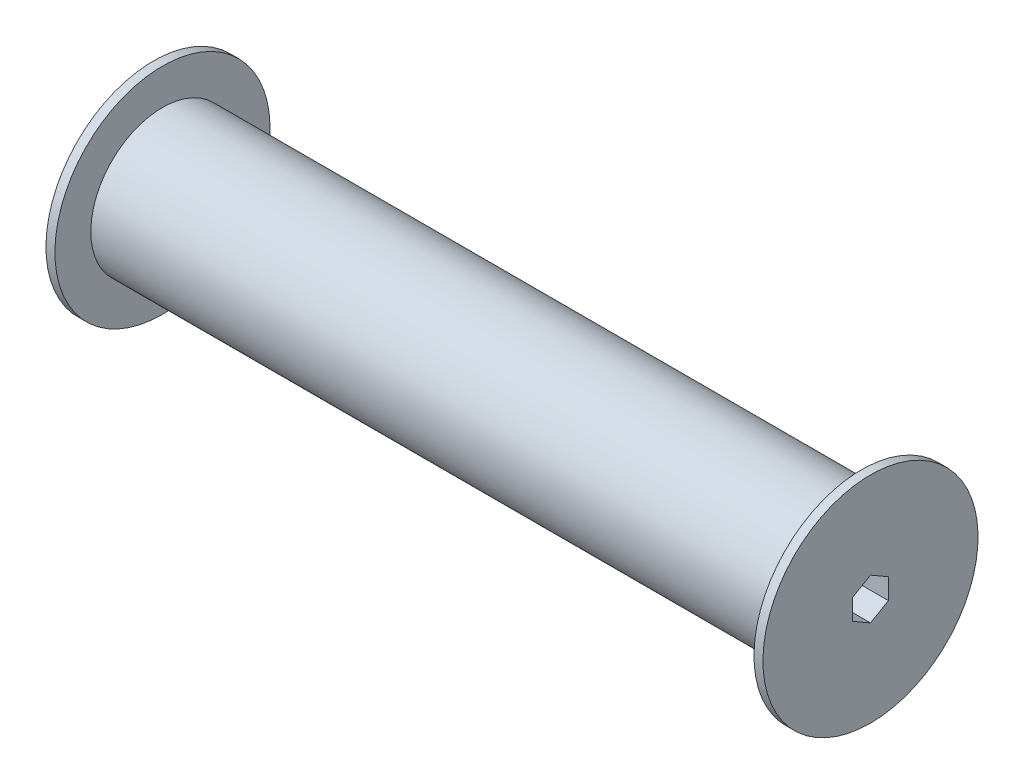
ISO-10303-21;
HEADER;
FILE_DESCRIPTION(('STEP AP214'),'2;1');
FILE_NAME('part.step','',(''),(''),'','','');
FILE_SCHEMA(('AUTOMOTIVE_DESIGN { 1 0 10303 214 1 1 1 1 }'));
ENDSEC;
DATA;
#1=APPLICATION_CONTEXT('core data for automotive mechanical design processes');
#2=APPLICATION_PROTOCOL_DEFINITION('international standard','automotive_design',2000,#1);
#3=PRODUCT_CONTEXT('',#1,'mechanical');
#4=PRODUCT('Part','Part','',(#3));
#5=PRODUCT_RELATED_PRODUCT_CATEGORY('part','',(#4));
#6=PRODUCT_DEFINITION_FORMATION('','',#4);
#7=PRODUCT_DEFINITION_CONTEXT('part definition',#1,'design');
#8=PRODUCT_DEFINITION('design','',#6,#7);
#9=PRODUCT_DEFINITION_SHAPE('','',#8);
#10=(LENGTH_UNIT() NAMED_UNIT(*) SI_UNIT(.MILLI.,.METRE.));
#11=(NAMED_UNIT(*) PLANE_ANGLE_UNIT() SI_UNIT($,.RADIAN.));
#12=(NAMED_UNIT(*) SI_UNIT($,.STERADIAN.) SOLID_ANGLE_UNIT());
#13=UNCERTAINTY_MEASURE_WITH_UNIT(LENGTH_MEASURE(1.E-05),#10,'distance_accuracy_value','');
#14=(GEOMETRIC_REPRESENTATION_CONTEXT(3) GLOBAL_UNCERTAINTY_ASSIGNED_CONTEXT((#13)) GLOBAL_UNIT_ASSIGNED_CONTEXT((#10,
#11,#12)) REPRESENTATION_CONTEXT('',''));
#15=CARTESIAN_POINT('',(0.,0.,0.));
#16=DIRECTION('',(0.,0.,1.));
#17=DIRECTION('',(1.,0.,0.));
#18=AXIS2_PLACEMENT_3D('',#15,#16,#17);
#19=CARTESIAN_POINT('',(-127.,0.,0.));
#20=DIRECTION('',(-1.,0.,0.));
#21=DIRECTION('',(0.,-1.,0.));
#22=AXIS2_PLACEMENT_3D('',#19,#20,#21);
#23=CYLINDRICAL_SURFACE('',#22,38.1);
#24=CARTESIAN_POINT('',(-127.,0.,0.));
#25=DIRECTION('',(-1.,0.,0.));
#26=DIRECTION('',(0.,-1.,0.));
#27=AXIS2_PLACEMENT_3D('',#24,#25,#26);
#28=CIRCLE('',#27,38.1);
#29=CARTESIAN_POINT('',(-127.,-38.1,0.));
#30=VERTEX_POINT('',#29);
#31=EDGE_CURVE('E11',#30,#30,#28,.T.);
#32=ORIENTED_EDGE('',*,*,#31,.F.);
#33=EDGE_LOOP('',(#32));
#34=FACE_BOUND('',#33,.T.);
#35=CARTESIAN_POINT('',(-123.825,0.,0.));
#36=DIRECTION('',(-1.,0.,0.));
#37=DIRECTION('',(0.,-1.,0.));
#38=AXIS2_PLACEMENT_3D('',#35,#36,#37);
#39=CIRCLE('',#38,38.1);
#40=CARTESIAN_POINT('',(-123.825,-38.1,0.));
#41=VERTEX_POINT('',#40);
#42=EDGE_CURVE('E130',#41,#41,#39,.T.);
#43=ORIENTED_EDGE('',*,*,#42,.T.);
#44=EDGE_LOOP('',(#43));
#45=FACE_BOUND('',#44,.T.);
#46=ADVANCED_FACE('F33',(#34,#45),#23,.T.);
#47=CARTESIAN_POINT('',(-127.,38.1,0.));
#48=DIRECTION('',(1.,0.,0.));
#49=DIRECTION('',(0.,1.,0.));
#50=AXIS2_PLACEMENT_3D('',#47,#48,#49);
#51=PLANE('',#50);
#52=DIRECTION('',(0.,1.,0.));
#53=VECTOR('',#52,1.);
#54=CARTESIAN_POINT('',(-127.,-3.6661742093541,-6.35));
#55=LINE('',#54,#53);
#56=CARTESIAN_POINT('',(-127.,-3.6661742093541,-6.35));
#57=VERTEX_POINT('',#56);
#58=CARTESIAN_POINT('',(-127.,3.66617420935415,-6.35));
#59=VERTEX_POINT('',#58);
#60=EDGE_CURVE('E93',#57,#59,#55,.T.);
#61=ORIENTED_EDGE('',*,*,#60,.T.);
#62=DIRECTION('',(0.,0.5,0.866025403784439));
#63=VECTOR('',#62,1.);
#64=CARTESIAN_POINT('',(-127.,3.66617420935415,-6.35));
#65=LINE('',#64,#63);
#66=CARTESIAN_POINT('',(-127.,7.33234841870827,0.));
#67=VERTEX_POINT('',#66);
#68=EDGE_CURVE('E87',#59,#67,#65,.T.);
#69=ORIENTED_EDGE('',*,*,#68,.T.);
#70=DIRECTION('',(0.,-0.5,0.866025403784439));
#71=VECTOR('',#70,1.);
#72=CARTESIAN_POINT('',(-127.,7.33234841870827,0.));
#73=LINE('',#72,#71);
#74=CARTESIAN_POINT('',(-127.,3.66617420935416,6.35));
#75=VERTEX_POINT('',#74);
#76=EDGE_CURVE('E96',#67,#75,#73,.T.);
#77=ORIENTED_EDGE('',*,*,#76,.T.);
#78=DIRECTION('',(0.,-1.,0.));
#79=VECTOR('',#78,1.);
#80=CARTESIAN_POINT('',(-127.,3.66617420935415,6.35));
#81=LINE('',#80,#79);
#82=CARTESIAN_POINT('',(-127.,-3.6661742093541,6.35));
#83=VERTEX_POINT('',#82);
#84=EDGE_CURVE('E47',#75,#83,#81,.T.);
#85=ORIENTED_EDGE('',*,*,#84,.T.);
#86=DIRECTION('',(0.,-0.5,-0.866025403784439));
#87=VECTOR('',#86,1.);
#88=CARTESIAN_POINT('',(-127.,-3.6661742093541,6.35));
#89=LINE('',#88,#87);
#90=CARTESIAN_POINT('',(-127.,-7.33234841870822,0.));
#91=VERTEX_POINT('',#90);
#92=EDGE_CURVE('E111',#83,#91,#89,.T.);
#93=ORIENTED_EDGE('',*,*,#92,.T.);
#94=DIRECTION('',(0.,0.5,-0.866025403784439));
#95=VECTOR('',#94,1.);
#96=CARTESIAN_POINT('',(-127.,-7.33234841870822,0.));
#97=LINE('',#96,#95);
#98=EDGE_CURVE('E114',#91,#57,#97,.T.);
#99=ORIENTED_EDGE('',*,*,#98,.T.);
#100=EDGE_LOOP('',(#61,#69,#77,#85,#93,#99));
#101=FACE_BOUND('',#100,.T.);
#102=ORIENTED_EDGE('',*,*,#31,.T.);
#103=EDGE_LOOP('',(#102));
#104=FACE_BOUND('',#103,.T.);
#105=ADVANCED_FACE('F100',(#101,#104),#51,.F.);
#106=CARTESIAN_POINT('',(127.,0.,0.));
#107=DIRECTION('',(-1.,0.,0.));
#108=DIRECTION('',(0.,-1.,0.));
#109=AXIS2_PLACEMENT_3D('',#106,#107,#108);
#110=PLANE('',#109);
#111=DIRECTION('',(0.,-0.5,0.866025403784439));
#112=VECTOR('',#111,1.);
#113=CARTESIAN_POINT('',(127.,7.33234841870827,0.));
#114=LINE('',#113,#112);
#115=CARTESIAN_POINT('',(127.,7.33234841870827,0.));
#116=VERTEX_POINT('',#115);
#117=CARTESIAN_POINT('',(127.,3.66617420935415,6.35));
#118=VERTEX_POINT('',#117);
#119=EDGE_CURVE('E118',#116,#118,#114,.T.);
#120=ORIENTED_EDGE('',*,*,#119,.F.);
#121=DIRECTION('',(0.,0.5,0.866025403784439));
#122=VECTOR('',#121,1.);
#123=CARTESIAN_POINT('',(127.,3.66617420935415,-6.35));
#124=LINE('',#123,#122);
#125=CARTESIAN_POINT('',(127.,3.66617420935415,-6.35));
#126=VERTEX_POINT('',#125);
#127=EDGE_CURVE('E55',#126,#116,#124,.T.);
#128=ORIENTED_EDGE('',*,*,#127,.F.);
#129=DIRECTION('',(0.,1.,0.));
#130=VECTOR('',#129,1.);
#131=CARTESIAN_POINT('',(127.,-3.6661742093541,-6.35));
#132=LINE('',#131,#130);
#133=CARTESIAN_POINT('',(127.,-3.6661742093541,-6.35));
#134=VERTEX_POINT('',#133);
#135=EDGE_CURVE('E104',#134,#126,#132,.T.);
#136=ORIENTED_EDGE('',*,*,#135,.F.);
#137=DIRECTION('',(0.,0.5,-0.866025403784439));
#138=VECTOR('',#137,1.);
#139=CARTESIAN_POINT('',(127.,-7.33234841870822,0.));
#140=LINE('',#139,#138);
#141=CARTESIAN_POINT('',(127.,-7.33234841870822,0.));
#142=VERTEX_POINT('',#141);
#143=EDGE_CURVE('E107',#142,#134,#140,.T.);
#144=ORIENTED_EDGE('',*,*,#143,.F.);
#145=DIRECTION('',(0.,-0.5,-0.866025403784439));
#146=VECTOR('',#145,1.);
#147=CARTESIAN_POINT('',(127.,-3.6661742093541,6.35));
#148=LINE('',#147,#146);
#149=CARTESIAN_POINT('',(127.,-3.6661742093541,6.35));
#150=VERTEX_POINT('',#149);
#151=EDGE_CURVE('E123',#150,#142,#148,.T.);
#152=ORIENTED_EDGE('',*,*,#151,.F.);
#153=DIRECTION('',(0.,-1.,0.));
#154=VECTOR('',#153,1.);
#155=CARTESIAN_POINT('',(127.,3.66617420935415,6.35));
#156=LINE('',#155,#154);
#157=EDGE_CURVE('E120',#118,#150,#156,.T.);
#158=ORIENTED_EDGE('',*,*,#157,.F.);
#159=EDGE_LOOP('',(#120,#128,#136,#144,#152,#158));
#160=FACE_BOUND('',#159,.T.);
#161=CARTESIAN_POINT('',(127.,0.,0.));
#162=DIRECTION('',(-1.,0.,0.));
#163=DIRECTION('',(0.,-1.,0.));
#164=AXIS2_PLACEMENT_3D('',#161,#162,#163);
#165=CIRCLE('',#164,38.1);
#166=CARTESIAN_POINT('',(127.,-38.0999999999999,0.));
#167=VERTEX_POINT('',#166);
#168=EDGE_CURVE('E40',#167,#167,#165,.T.);
#169=ORIENTED_EDGE('',*,*,#168,.F.);
#170=EDGE_LOOP('',(#169));
#171=FACE_BOUND('',#170,.T.);
#172=ADVANCED_FACE('F153',(#160,#171),#110,.F.);
#173=CARTESIAN_POINT('',(-127.,0.,0.));
#174=DIRECTION('',(-1.,0.,0.));
#175=DIRECTION('',(0.,-1.,0.));
#176=AXIS2_PLACEMENT_3D('',#173,#174,#175);
#177=CYLINDRICAL_SURFACE('',#176,38.1);
#178=CARTESIAN_POINT('',(123.825,0.,0.));
#179=DIRECTION('',(-1.,0.,0.));
#180=DIRECTION('',(0.,-1.,0.));
#181=AXIS2_PLACEMENT_3D('',#178,#179,#180);
#182=CIRCLE('',#181,38.1);
#183=CARTESIAN_POINT('',(123.825,-38.0999999999999,0.));
#184=VERTEX_POINT('',#183);
#185=EDGE_CURVE('E146',#184,#184,#182,.T.);
#186=ORIENTED_EDGE('',*,*,#185,.F.);
#187=EDGE_LOOP('',(#186));
#188=FACE_BOUND('',#187,.T.);
#189=ORIENTED_EDGE('',*,*,#168,.T.);
#190=EDGE_LOOP('',(#189));
#191=FACE_BOUND('',#190,.T.);
#192=ADVANCED_FACE('F151',(#188,#191),#177,.T.);
#193=CARTESIAN_POINT('',(123.825,38.1,0.));
#194=DIRECTION('',(1.,0.,0.));
#195=DIRECTION('',(0.,1.,0.));
#196=AXIS2_PLACEMENT_3D('',#193,#194,#195);
#197=PLANE('',#196);
#198=CARTESIAN_POINT('',(123.825,0.,0.));
#199=DIRECTION('',(-1.,0.,0.));
#200=DIRECTION('',(0.,-1.,0.));
#201=AXIS2_PLACEMENT_3D('',#198,#199,#200);
#202=CIRCLE('',#201,25.4);
#203=CARTESIAN_POINT('',(123.825,-25.3999999999999,0.));
#204=VERTEX_POINT('',#203);
#205=EDGE_CURVE('E143',#204,#204,#202,.T.);
#206=ORIENTED_EDGE('',*,*,#205,.F.);
#207=EDGE_LOOP('',(#206));
#208=FACE_BOUND('',#207,.T.);
#209=ORIENTED_EDGE('',*,*,#185,.T.);
#210=EDGE_LOOP('',(#209));
#211=FACE_BOUND('',#210,.T.);
#212=ADVANCED_FACE('F161',(#208,#211),#197,.F.);
#213=CARTESIAN_POINT('',(-127.,0.,0.));
#214=DIRECTION('',(-1.,0.,0.));
#215=DIRECTION('',(0.,-1.,0.));
#216=AXIS2_PLACEMENT_3D('',#213,#214,#215);
#217=CYLINDRICAL_SURFACE('',#216,25.4);
#218=CARTESIAN_POINT('',(-123.825,0.,0.));
#219=DIRECTION('',(-1.,0.,0.));
#220=DIRECTION('',(0.,-1.,0.));
#221=AXIS2_PLACEMENT_3D('',#218,#219,#220);
#222=CIRCLE('',#221,25.4);
#223=CARTESIAN_POINT('',(-123.825,-25.4,0.));
#224=VERTEX_POINT('',#223);
#225=EDGE_CURVE('E140',#224,#224,#222,.T.);
#226=ORIENTED_EDGE('',*,*,#225,.F.);
#227=EDGE_LOOP('',(#226));
#228=FACE_BOUND('',#227,.T.);
#229=ORIENTED_EDGE('',*,*,#205,.T.);
#230=EDGE_LOOP('',(#229));
#231=FACE_BOUND('',#230,.T.);
#232=ADVANCED_FACE('F175',(#228,#231),#217,.T.);
#233=CARTESIAN_POINT('',(-123.825,25.4,0.));
#234=DIRECTION('',(-1.,0.,0.));
#235=DIRECTION('',(0.,-1.,0.));
#236=AXIS2_PLACEMENT_3D('',#233,#234,#235);
#237=PLANE('',#236);
#238=ORIENTED_EDGE('',*,*,#42,.F.);
#239=EDGE_LOOP('',(#238));
#240=FACE_BOUND('',#239,.T.);
#241=ORIENTED_EDGE('',*,*,#225,.T.);
#242=EDGE_LOOP('',(#241));
#243=FACE_BOUND('',#242,.T.);
#244=ADVANCED_FACE('F172',(#240,#243),#237,.F.);
#245=CARTESIAN_POINT('',(-127.,3.66617420935415,-6.35));
#246=DIRECTION('',(0.,0.866025403784439,-0.5));
#247=DIRECTION('',(0.,0.5,0.866025403784439));
#248=AXIS2_PLACEMENT_3D('',#245,#246,#247);
#249=PLANE('',#248);
#250=ORIENTED_EDGE('',*,*,#127,.T.);
#251=DIRECTION('',(1.,0.,0.));
#252=VECTOR('',#251,1.);
#253=CARTESIAN_POINT('',(-127.,7.33234841870827,0.));
#254=LINE('',#253,#252);
#255=EDGE_CURVE('E83',#67,#116,#254,.T.);
#256=ORIENTED_EDGE('',*,*,#255,.F.);
#257=ORIENTED_EDGE('',*,*,#68,.F.);
#258=DIRECTION('',(1.,0.,0.));
#259=VECTOR('',#258,1.);
#260=CARTESIAN_POINT('',(-127.,3.66617420935415,-6.35));
#261=LINE('',#260,#259);
#262=EDGE_CURVE('E128',#59,#126,#261,.T.);
#263=ORIENTED_EDGE('',*,*,#262,.T.);
#264=EDGE_LOOP('',(#250,#256,#257,#263));
#265=FACE_BOUND('',#264,.T.);
#266=ADVANCED_FACE('F85',(#265),#249,.F.);
#267=CARTESIAN_POINT('',(-127.,-3.6661742093541,-6.35));
#268=DIRECTION('',(0.,0.,-1.));
#269=DIRECTION('',(0.,1.,0.));
#270=AXIS2_PLACEMENT_3D('',#267,#268,#269);
#271=PLANE('',#270);
#272=ORIENTED_EDGE('',*,*,#135,.T.);
#273=ORIENTED_EDGE('',*,*,#262,.F.);
#274=ORIENTED_EDGE('',*,*,#60,.F.);
#275=DIRECTION('',(1.,0.,0.));
#276=VECTOR('',#275,1.);
#277=CARTESIAN_POINT('',(-127.,-3.6661742093541,-6.35));
#278=LINE('',#277,#276);
#279=EDGE_CURVE('E131',#57,#134,#278,.T.);
#280=ORIENTED_EDGE('',*,*,#279,.T.);
#281=EDGE_LOOP('',(#272,#273,#274,#280));
#282=FACE_BOUND('',#281,.T.);
#283=ADVANCED_FACE('F193',(#282),#271,.F.);
#284=CARTESIAN_POINT('',(-127.,-7.33234841870822,0.));
#285=DIRECTION('',(0.,-0.866025403784439,-0.5));
#286=DIRECTION('',(0.,0.5,-0.866025403784439));
#287=AXIS2_PLACEMENT_3D('',#284,#285,#286);
#288=PLANE('',#287);
#289=ORIENTED_EDGE('',*,*,#143,.T.);
#290=ORIENTED_EDGE('',*,*,#279,.F.);
#291=ORIENTED_EDGE('',*,*,#98,.F.);
#292=DIRECTION('',(1.,0.,0.));
#293=VECTOR('',#292,1.);
#294=CARTESIAN_POINT('',(-127.,-7.33234841870822,0.));
#295=LINE('',#294,#293);
#296=EDGE_CURVE('E133',#91,#142,#295,.T.);
#297=ORIENTED_EDGE('',*,*,#296,.T.);
#298=EDGE_LOOP('',(#289,#290,#291,#297));
#299=FACE_BOUND('',#298,.T.);
#300=ADVANCED_FACE('F202',(#299),#288,.F.);
#301=CARTESIAN_POINT('',(-127.,-3.6661742093541,6.35));
#302=DIRECTION('',(0.,-0.866025403784439,0.5));
#303=DIRECTION('',(0.,-0.5,-0.866025403784439));
#304=AXIS2_PLACEMENT_3D('',#301,#302,#303);
#305=PLANE('',#304);
#306=ORIENTED_EDGE('',*,*,#151,.T.);
#307=ORIENTED_EDGE('',*,*,#296,.F.);
#308=ORIENTED_EDGE('',*,*,#92,.F.);
#309=DIRECTION('',(1.,0.,0.));
#310=VECTOR('',#309,1.);
#311=CARTESIAN_POINT('',(-127.,-3.6661742093541,6.35));
#312=LINE('',#311,#310);
#313=EDGE_CURVE('E135',#83,#150,#312,.T.);
#314=ORIENTED_EDGE('',*,*,#313,.T.);
#315=EDGE_LOOP('',(#306,#307,#308,#314));
#316=FACE_BOUND('',#315,.T.);
#317=ADVANCED_FACE('F199',(#316),#305,.F.);
#318=CARTESIAN_POINT('',(-127.,3.66617420935415,6.35));
#319=DIRECTION('',(0.,0.,1.));
#320=DIRECTION('',(0.,-1.,0.));
#321=AXIS2_PLACEMENT_3D('',#318,#319,#320);
#322=PLANE('',#321);
#323=ORIENTED_EDGE('',*,*,#157,.T.);
#324=ORIENTED_EDGE('',*,*,#313,.F.);
#325=ORIENTED_EDGE('',*,*,#84,.F.);
#326=DIRECTION('',(1.,0.,0.));
#327=VECTOR('',#326,1.);
#328=CARTESIAN_POINT('',(-127.,3.66617420935415,6.35));
#329=LINE('',#328,#327);
#330=EDGE_CURVE('E92',#75,#118,#329,.T.);
#331=ORIENTED_EDGE('',*,*,#330,.T.);
#332=EDGE_LOOP('',(#323,#324,#325,#331));
#333=FACE_BOUND('',#332,.T.);
#334=ADVANCED_FACE('F196',(#333),#322,.F.);
#335=CARTESIAN_POINT('',(-127.,7.33234841870827,0.));
#336=DIRECTION('',(0.,0.866025403784439,0.5));
#337=DIRECTION('',(0.,-0.5,0.866025403784439));
#338=AXIS2_PLACEMENT_3D('',#335,#336,#337);
#339=PLANE('',#338);
#340=ORIENTED_EDGE('',*,*,#119,.T.);
#341=ORIENTED_EDGE('',*,*,#330,.F.);
#342=ORIENTED_EDGE('',*,*,#76,.F.);
#343=ORIENTED_EDGE('',*,*,#255,.T.);
#344=EDGE_LOOP('',(#340,#341,#342,#343));
#345=FACE_BOUND('',#344,.T.);
#346=ADVANCED_FACE('F97',(#345),#339,.F.);
#347=CLOSED_SHELL('',(#46,#105,#172,#192,#212,#232,#244,#266,#283,#300,#317,#334,#346));
#348=MANIFOLD_SOLID_BREP('B2',#347);
#349=ADVANCED_BREP_SHAPE_REPRESENTATION('',(#18,#348),#14);
#350=SHAPE_DEFINITION_REPRESENTATION(#9,#349);
ENDSEC;
END-ISO-10303-21;
